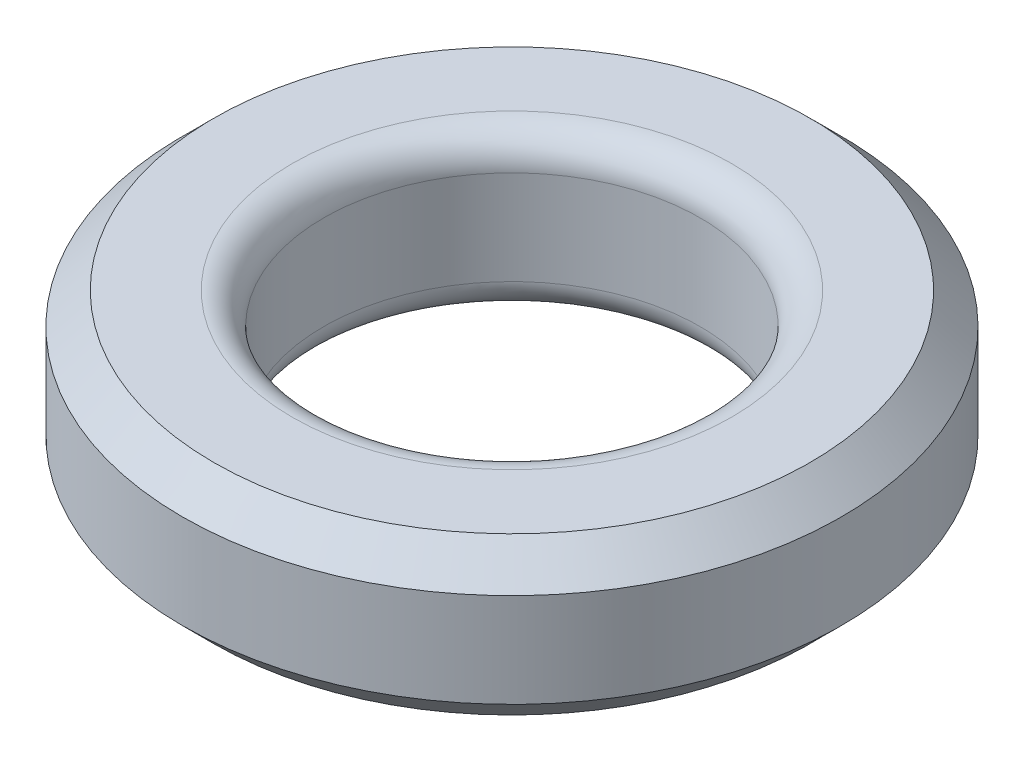
ISO-10303-21;
HEADER;
FILE_DESCRIPTION(('STEP AP214'),'2;1');
FILE_NAME('part.step','',(''),(''),'','','');
FILE_SCHEMA(('AUTOMOTIVE_DESIGN { 1 0 10303 214 1 1 1 1 }'));
ENDSEC;
DATA;
#1=APPLICATION_CONTEXT('core data for automotive mechanical design processes');
#2=APPLICATION_PROTOCOL_DEFINITION('international standard','automotive_design',2000,#1);
#3=PRODUCT_CONTEXT('',#1,'mechanical');
#4=PRODUCT('Part','Part','',(#3));
#5=PRODUCT_RELATED_PRODUCT_CATEGORY('part','',(#4));
#6=PRODUCT_DEFINITION_FORMATION('','',#4);
#7=PRODUCT_DEFINITION_CONTEXT('part definition',#1,'design');
#8=PRODUCT_DEFINITION('design','',#6,#7);
#9=PRODUCT_DEFINITION_SHAPE('','',#8);
#10=(LENGTH_UNIT() NAMED_UNIT(*) SI_UNIT(.MILLI.,.METRE.));
#11=(NAMED_UNIT(*) PLANE_ANGLE_UNIT() SI_UNIT($,.RADIAN.));
#12=(NAMED_UNIT(*) SI_UNIT($,.STERADIAN.) SOLID_ANGLE_UNIT());
#13=UNCERTAINTY_MEASURE_WITH_UNIT(LENGTH_MEASURE(1.E-05),#10,'distance_accuracy_value','');
#14=(GEOMETRIC_REPRESENTATION_CONTEXT(3) GLOBAL_UNCERTAINTY_ASSIGNED_CONTEXT((#13)) GLOBAL_UNIT_ASSIGNED_CONTEXT((#10,
#11,#12)) REPRESENTATION_CONTEXT('',''));
#15=CARTESIAN_POINT('',(0.,0.,0.));
#16=DIRECTION('',(0.,0.,1.));
#17=DIRECTION('',(1.,0.,0.));
#18=AXIS2_PLACEMENT_3D('',#15,#16,#17);
#19=CARTESIAN_POINT('',(0.,5.,0.));
#20=DIRECTION('',(0.,1.,0.));
#21=DIRECTION('',(0.,0.,1.));
#22=AXIS2_PLACEMENT_3D('',#19,#20,#21);
#23=PLANE('',#22);
#24=CARTESIAN_POINT('',(0.,5.,0.));
#25=DIRECTION('',(0.,1.,0.));
#26=DIRECTION('',(0.,0.,1.));
#27=AXIS2_PLACEMENT_3D('',#24,#25,#26);
#28=CIRCLE('',#27,9.50000000000001);
#29=CARTESIAN_POINT('',(0.,5.,9.50000000000001));
#30=VERTEX_POINT('',#29);
#31=EDGE_CURVE('E72',#30,#30,#28,.T.);
#32=ORIENTED_EDGE('',*,*,#31,.T.);
#33=EDGE_LOOP('',(#32));
#34=FACE_BOUND('',#33,.T.);
#35=CARTESIAN_POINT('',(0.,5.,0.));
#36=DIRECTION('',(0.,1.,0.));
#37=DIRECTION('',(0.,0.,1.));
#38=AXIS2_PLACEMENT_3D('',#35,#36,#37);
#39=CIRCLE('',#38,7.);
#40=CARTESIAN_POINT('',(0.,5.,7.));
#41=VERTEX_POINT('',#40);
#42=EDGE_CURVE('E77',#41,#41,#39,.F.);
#43=ORIENTED_EDGE('',*,*,#42,.T.);
#44=EDGE_LOOP('',(#43));
#45=FACE_BOUND('',#44,.T.);
#46=ADVANCED_FACE('F50',(#34,#45),#23,.T.);
#47=CARTESIAN_POINT('',(0.,0.,0.));
#48=DIRECTION('',(0.,1.,0.));
#49=DIRECTION('',(0.,0.,1.));
#50=AXIS2_PLACEMENT_3D('',#47,#48,#49);
#51=PLANE('',#50);
#52=CARTESIAN_POINT('',(0.,0.,0.));
#53=DIRECTION('',(0.,1.,0.));
#54=DIRECTION('',(0.,0.,1.));
#55=AXIS2_PLACEMENT_3D('',#52,#53,#54);
#56=CIRCLE('',#55,9.49999999999999);
#57=CARTESIAN_POINT('',(0.,0.,9.49999999999999));
#58=VERTEX_POINT('',#57);
#59=EDGE_CURVE('E12',#58,#58,#56,.F.);
#60=ORIENTED_EDGE('',*,*,#59,.T.);
#61=EDGE_LOOP('',(#60));
#62=FACE_BOUND('',#61,.T.);
#63=CARTESIAN_POINT('',(0.,0.,0.));
#64=DIRECTION('',(0.,1.,0.));
#65=DIRECTION('',(0.,0.,1.));
#66=AXIS2_PLACEMENT_3D('',#63,#64,#65);
#67=CIRCLE('',#66,7.);
#68=CARTESIAN_POINT('',(0.,0.,7.));
#69=VERTEX_POINT('',#68);
#70=EDGE_CURVE('E88',#69,#69,#67,.T.);
#71=ORIENTED_EDGE('',*,*,#70,.T.);
#72=EDGE_LOOP('',(#71));
#73=FACE_BOUND('',#72,.T.);
#74=ADVANCED_FACE('F94',(#62,#73),#51,.F.);
#75=CARTESIAN_POINT('',(0.,5.,0.));
#76=DIRECTION('',(0.,-1.,0.));
#77=DIRECTION('',(0.,0.,-1.));
#78=AXIS2_PLACEMENT_3D('',#75,#76,#77);
#79=CYLINDRICAL_SURFACE('',#78,10.5);
#80=CARTESIAN_POINT('',(0.,4.,0.));
#81=DIRECTION('',(0.,1.,0.));
#82=DIRECTION('',(0.,0.,1.));
#83=AXIS2_PLACEMENT_3D('',#80,#81,#82);
#84=CIRCLE('',#83,10.5);
#85=CARTESIAN_POINT('',(0.,4.,10.5));
#86=VERTEX_POINT('',#85);
#87=EDGE_CURVE('E58',#86,#86,#84,.F.);
#88=ORIENTED_EDGE('',*,*,#87,.T.);
#89=EDGE_LOOP('',(#88));
#90=FACE_BOUND('',#89,.T.);
#91=CARTESIAN_POINT('',(0.,1.,0.));
#92=DIRECTION('',(0.,1.,0.));
#93=DIRECTION('',(0.,0.,1.));
#94=AXIS2_PLACEMENT_3D('',#91,#92,#93);
#95=CIRCLE('',#94,10.5);
#96=CARTESIAN_POINT('',(0.,1.,10.5));
#97=VERTEX_POINT('',#96);
#98=EDGE_CURVE('E66',#97,#97,#95,.T.);
#99=ORIENTED_EDGE('',*,*,#98,.T.);
#100=EDGE_LOOP('',(#99));
#101=FACE_BOUND('',#100,.T.);
#102=ADVANCED_FACE('F109',(#90,#101),#79,.T.);
#103=CARTESIAN_POINT('',(0.,5.,0.));
#104=DIRECTION('',(0.,-1.,0.));
#105=DIRECTION('',(0.,0.,-1.));
#106=AXIS2_PLACEMENT_3D('',#103,#104,#105);
#107=CYLINDRICAL_SURFACE('',#106,6.);
#108=CARTESIAN_POINT('',(0.,1.,0.));
#109=DIRECTION('',(0.,1.,0.));
#110=DIRECTION('',(0.,0.,1.));
#111=AXIS2_PLACEMENT_3D('',#108,#109,#110);
#112=CIRCLE('',#111,6.);
#113=CARTESIAN_POINT('',(0.,1.,6.));
#114=VERTEX_POINT('',#113);
#115=EDGE_CURVE('E81',#114,#114,#112,.F.);
#116=ORIENTED_EDGE('',*,*,#115,.T.);
#117=EDGE_LOOP('',(#116));
#118=FACE_BOUND('',#117,.T.);
#119=CARTESIAN_POINT('',(0.,4.,0.));
#120=DIRECTION('',(0.,1.,0.));
#121=DIRECTION('',(0.,0.,1.));
#122=AXIS2_PLACEMENT_3D('',#119,#120,#121);
#123=CIRCLE('',#122,6.);
#124=CARTESIAN_POINT('',(0.,4.,6.));
#125=VERTEX_POINT('',#124);
#126=EDGE_CURVE('E85',#125,#125,#123,.T.);
#127=ORIENTED_EDGE('',*,*,#126,.T.);
#128=EDGE_LOOP('',(#127));
#129=FACE_BOUND('',#128,.T.);
#130=ADVANCED_FACE('F99',(#118,#129),#107,.F.);
#131=CARTESIAN_POINT('',(0.,1.,0.));
#132=DIRECTION('',(0.,1.,0.));
#133=DIRECTION('',(0.,0.,1.));
#134=AXIS2_PLACEMENT_3D('',#131,#132,#133);
#135=TOROIDAL_SURFACE('',#134,7.,1.);
#136=ORIENTED_EDGE('',*,*,#115,.F.);
#137=EDGE_LOOP('',(#136));
#138=FACE_BOUND('',#137,.T.);
#139=ORIENTED_EDGE('',*,*,#70,.F.);
#140=EDGE_LOOP('',(#139));
#141=FACE_BOUND('',#140,.T.);
#142=ADVANCED_FACE('F96',(#138,#141),#135,.T.);
#143=CARTESIAN_POINT('',(0.,4.,0.));
#144=DIRECTION('',(0.,1.,0.));
#145=DIRECTION('',(0.,0.,1.));
#146=AXIS2_PLACEMENT_3D('',#143,#144,#145);
#147=TOROIDAL_SURFACE('',#146,7.,1.);
#148=ORIENTED_EDGE('',*,*,#42,.F.);
#149=EDGE_LOOP('',(#148));
#150=FACE_BOUND('',#149,.T.);
#151=ORIENTED_EDGE('',*,*,#126,.F.);
#152=EDGE_LOOP('',(#151));
#153=FACE_BOUND('',#152,.T.);
#154=ADVANCED_FACE('F98',(#150,#153),#147,.T.);
#155=CARTESIAN_POINT('',(0.,5.,0.));
#156=DIRECTION('',(0.,-1.,0.));
#157=DIRECTION('',(0.,0.,-1.));
#158=AXIS2_PLACEMENT_3D('',#155,#156,#157);
#159=CONICAL_SURFACE('',#158,9.50000000000001,0.785398163397447);
#160=ORIENTED_EDGE('',*,*,#87,.F.);
#161=EDGE_LOOP('',(#160));
#162=FACE_BOUND('',#161,.T.);
#163=ORIENTED_EDGE('',*,*,#31,.F.);
#164=EDGE_LOOP('',(#163));
#165=FACE_BOUND('',#164,.T.);
#166=ADVANCED_FACE('F106',(#162,#165),#159,.T.);
#167=CARTESIAN_POINT('',(0.,1.,0.));
#168=DIRECTION('',(0.,1.,0.));
#169=DIRECTION('',(0.,0.,1.));
#170=AXIS2_PLACEMENT_3D('',#167,#168,#169);
#171=CONICAL_SURFACE('',#170,10.5,0.785398163397451);
#172=ORIENTED_EDGE('',*,*,#59,.F.);
#173=EDGE_LOOP('',(#172));
#174=FACE_BOUND('',#173,.T.);
#175=ORIENTED_EDGE('',*,*,#98,.F.);
#176=EDGE_LOOP('',(#175));
#177=FACE_BOUND('',#176,.T.);
#178=ADVANCED_FACE('F52',(#174,#177),#171,.T.);
#179=CLOSED_SHELL('',(#46,#74,#102,#130,#142,#154,#166,#178));
#180=MANIFOLD_SOLID_BREP('B2',#179);
#181=ADVANCED_BREP_SHAPE_REPRESENTATION('',(#18,#180),#14);
#182=SHAPE_DEFINITION_REPRESENTATION(#9,#181);
ENDSEC;
END-ISO-10303-21;
